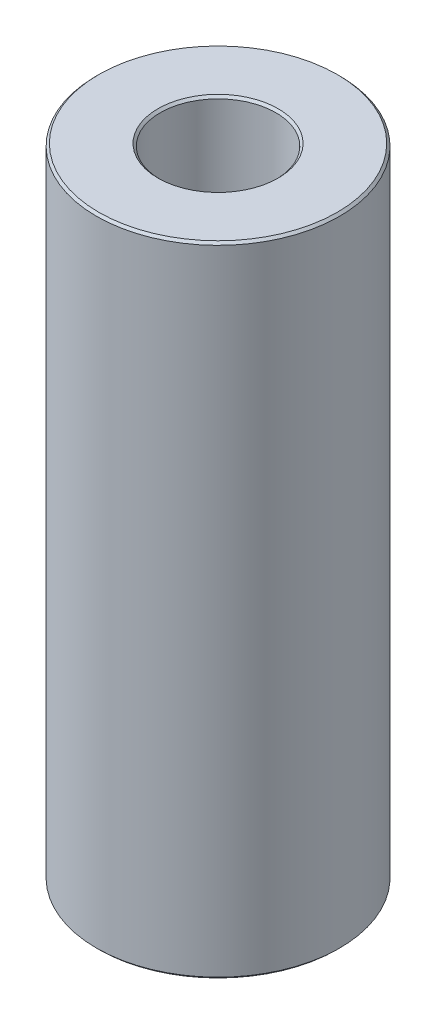
ISO-10303-21;
HEADER;
FILE_DESCRIPTION(('STEP AP214'),'2;1');
FILE_NAME('part.step','',(''),(''),'','','');
FILE_SCHEMA(('AUTOMOTIVE_DESIGN { 1 0 10303 214 1 1 1 1 }'));
ENDSEC;
DATA;
#1=APPLICATION_CONTEXT('core data for automotive mechanical design processes');
#2=APPLICATION_PROTOCOL_DEFINITION('international standard','automotive_design',2000,#1);
#3=PRODUCT_CONTEXT('',#1,'mechanical');
#4=PRODUCT('Part','Part','',(#3));
#5=PRODUCT_RELATED_PRODUCT_CATEGORY('part','',(#4));
#6=PRODUCT_DEFINITION_FORMATION('','',#4);
#7=PRODUCT_DEFINITION_CONTEXT('part definition',#1,'design');
#8=PRODUCT_DEFINITION('design','',#6,#7);
#9=PRODUCT_DEFINITION_SHAPE('','',#8);
#10=(LENGTH_UNIT() NAMED_UNIT(*) SI_UNIT(.MILLI.,.METRE.));
#11=(NAMED_UNIT(*) PLANE_ANGLE_UNIT() SI_UNIT($,.RADIAN.));
#12=(NAMED_UNIT(*) SI_UNIT($,.STERADIAN.) SOLID_ANGLE_UNIT());
#13=UNCERTAINTY_MEASURE_WITH_UNIT(LENGTH_MEASURE(1.E-05),#10,'distance_accuracy_value','');
#14=(GEOMETRIC_REPRESENTATION_CONTEXT(3) GLOBAL_UNCERTAINTY_ASSIGNED_CONTEXT((#13)) GLOBAL_UNIT_ASSIGNED_CONTEXT((#10,
#11,#12)) REPRESENTATION_CONTEXT('',''));
#15=CARTESIAN_POINT('',(0.,0.,0.));
#16=DIRECTION('',(0.,0.,1.));
#17=DIRECTION('',(1.,0.,0.));
#18=AXIS2_PLACEMENT_3D('',#15,#16,#17);
#19=CARTESIAN_POINT('',(0.,223.140577602893,0.));
#20=DIRECTION('',(0.,-1.,0.));
#21=DIRECTION('',(0.,0.,-1.));
#22=AXIS2_PLACEMENT_3D('',#19,#20,#21);
#23=CYLINDRICAL_SURFACE('',#22,42.5);
#24=CARTESIAN_POINT('',(0.,0.808248224856506,0.));
#25=DIRECTION('',(0.,1.,0.));
#26=DIRECTION('',(0.,0.,1.));
#27=AXIS2_PLACEMENT_3D('',#24,#25,#26);
#28=CIRCLE('',#27,42.5);
#29=CARTESIAN_POINT('',(0.,0.808248224856506,42.5));
#30=VERTEX_POINT('',#29);
#31=EDGE_CURVE('E10',#30,#30,#28,.T.);
#32=ORIENTED_EDGE('',*,*,#31,.T.);
#33=EDGE_LOOP('',(#32));
#34=FACE_BOUND('',#33,.T.);
#35=CARTESIAN_POINT('',(0.,222.332329378037,0.));
#36=DIRECTION('',(0.,1.,0.));
#37=DIRECTION('',(0.,0.,1.));
#38=AXIS2_PLACEMENT_3D('',#35,#36,#37);
#39=CIRCLE('',#38,42.5);
#40=CARTESIAN_POINT('',(0.,222.332329378037,42.5));
#41=VERTEX_POINT('',#40);
#42=EDGE_CURVE('E50',#41,#41,#39,.F.);
#43=ORIENTED_EDGE('',*,*,#42,.T.);
#44=EDGE_LOOP('',(#43));
#45=FACE_BOUND('',#44,.T.);
#46=ADVANCED_FACE('F39',(#34,#45),#23,.T.);
#47=CARTESIAN_POINT('',(0.,223.140577602893,0.));
#48=DIRECTION('',(0.,1.,0.));
#49=DIRECTION('',(0.,0.,1.));
#50=AXIS2_PLACEMENT_3D('',#47,#48,#49);
#51=PLANE('',#50);
#52=CARTESIAN_POINT('',(0.,223.140577602893,0.));
#53=DIRECTION('',(0.,1.,0.));
#54=DIRECTION('',(0.,0.,1.));
#55=AXIS2_PLACEMENT_3D('',#52,#53,#54);
#56=CIRCLE('',#55,21.0218103861378);
#57=CARTESIAN_POINT('',(0.,223.140577602893,21.0218103861378));
#58=VERTEX_POINT('',#57);
#59=EDGE_CURVE('E58',#58,#58,#56,.F.);
#60=ORIENTED_EDGE('',*,*,#59,.T.);
#61=EDGE_LOOP('',(#60));
#62=FACE_BOUND('',#61,.T.);
#63=CARTESIAN_POINT('',(0.,223.140577602893,0.));
#64=DIRECTION('',(0.,1.,0.));
#65=DIRECTION('',(0.,0.,1.));
#66=AXIS2_PLACEMENT_3D('',#63,#64,#65);
#67=CIRCLE('',#66,41.6917517751436);
#68=CARTESIAN_POINT('',(0.,223.140577602893,41.6917517751436));
#69=VERTEX_POINT('',#68);
#70=EDGE_CURVE('E61',#69,#69,#67,.T.);
#71=ORIENTED_EDGE('',*,*,#70,.T.);
#72=EDGE_LOOP('',(#71));
#73=FACE_BOUND('',#72,.T.);
#74=ADVANCED_FACE('F88',(#62,#73),#51,.T.);
#75=CARTESIAN_POINT('',(0.,0.,0.));
#76=DIRECTION('',(0.,1.,0.));
#77=DIRECTION('',(0.,0.,1.));
#78=AXIS2_PLACEMENT_3D('',#75,#76,#77);
#79=PLANE('',#78);
#80=CARTESIAN_POINT('',(0.,0.,0.));
#81=DIRECTION('',(0.,1.,0.));
#82=DIRECTION('',(0.,0.,1.));
#83=AXIS2_PLACEMENT_3D('',#80,#81,#82);
#84=CIRCLE('',#83,21.0218103861378);
#85=CARTESIAN_POINT('',(0.,0.,21.0218103861378));
#86=VERTEX_POINT('',#85);
#87=EDGE_CURVE('E51',#86,#86,#84,.T.);
#88=ORIENTED_EDGE('',*,*,#87,.T.);
#89=EDGE_LOOP('',(#88));
#90=FACE_BOUND('',#89,.T.);
#91=CARTESIAN_POINT('',(0.,0.,0.));
#92=DIRECTION('',(0.,1.,0.));
#93=DIRECTION('',(0.,0.,1.));
#94=AXIS2_PLACEMENT_3D('',#91,#92,#93);
#95=CIRCLE('',#94,41.6917517751435);
#96=CARTESIAN_POINT('',(0.,0.,41.6917517751435));
#97=VERTEX_POINT('',#96);
#98=EDGE_CURVE('E54',#97,#97,#95,.F.);
#99=ORIENTED_EDGE('',*,*,#98,.T.);
#100=EDGE_LOOP('',(#99));
#101=FACE_BOUND('',#100,.T.);
#102=ADVANCED_FACE('F83',(#90,#101),#79,.F.);
#103=CARTESIAN_POINT('',(0.,223.140577602893,0.));
#104=DIRECTION('',(0.,-1.,0.));
#105=DIRECTION('',(0.,0.,-1.));
#106=AXIS2_PLACEMENT_3D('',#103,#104,#105);
#107=CYLINDRICAL_SURFACE('',#106,20.2135621612813);
#108=CARTESIAN_POINT('',(0.,222.332329378037,0.));
#109=DIRECTION('',(0.,1.,0.));
#110=DIRECTION('',(0.,0.,1.));
#111=AXIS2_PLACEMENT_3D('',#108,#109,#110);
#112=CIRCLE('',#111,20.2135621612813);
#113=CARTESIAN_POINT('',(0.,222.332329378037,20.2135621612813));
#114=VERTEX_POINT('',#113);
#115=EDGE_CURVE('E67',#114,#114,#112,.T.);
#116=ORIENTED_EDGE('',*,*,#115,.T.);
#117=EDGE_LOOP('',(#116));
#118=FACE_BOUND('',#117,.T.);
#119=CARTESIAN_POINT('',(0.,0.808248224856478,0.));
#120=DIRECTION('',(0.,1.,0.));
#121=DIRECTION('',(0.,0.,1.));
#122=AXIS2_PLACEMENT_3D('',#119,#120,#121);
#123=CIRCLE('',#122,20.2135621612813);
#124=CARTESIAN_POINT('',(0.,0.808248224856478,20.2135621612813));
#125=VERTEX_POINT('',#124);
#126=EDGE_CURVE('E69',#125,#125,#123,.F.);
#127=ORIENTED_EDGE('',*,*,#126,.T.);
#128=EDGE_LOOP('',(#127));
#129=FACE_BOUND('',#128,.T.);
#130=ADVANCED_FACE('F71',(#118,#129),#107,.F.);
#131=CARTESIAN_POINT('',(0.,222.332329378037,0.));
#132=DIRECTION('',(0.,1.,0.));
#133=DIRECTION('',(0.,0.,1.));
#134=AXIS2_PLACEMENT_3D('',#131,#132,#133);
#135=CONICAL_SURFACE('',#134,20.2135621612813,0.785398163397446);
#136=ORIENTED_EDGE('',*,*,#59,.F.);
#137=EDGE_LOOP('',(#136));
#138=FACE_BOUND('',#137,.T.);
#139=ORIENTED_EDGE('',*,*,#115,.F.);
#140=EDGE_LOOP('',(#139));
#141=FACE_BOUND('',#140,.T.);
#142=ADVANCED_FACE('F77',(#138,#141),#135,.F.);
#143=CARTESIAN_POINT('',(0.,0.,0.));
#144=DIRECTION('',(0.,-1.,0.));
#145=DIRECTION('',(0.,0.,-1.));
#146=AXIS2_PLACEMENT_3D('',#143,#144,#145);
#147=CONICAL_SURFACE('',#146,21.0218103861378,0.785398163397429);
#148=ORIENTED_EDGE('',*,*,#126,.F.);
#149=EDGE_LOOP('',(#148));
#150=FACE_BOUND('',#149,.T.);
#151=ORIENTED_EDGE('',*,*,#87,.F.);
#152=EDGE_LOOP('',(#151));
#153=FACE_BOUND('',#152,.T.);
#154=ADVANCED_FACE('F73',(#150,#153),#147,.F.);
#155=CARTESIAN_POINT('',(0.,0.808248224856506,0.));
#156=DIRECTION('',(0.,1.,0.));
#157=DIRECTION('',(0.,0.,1.));
#158=AXIS2_PLACEMENT_3D('',#155,#156,#157);
#159=CONICAL_SURFACE('',#158,42.5,0.785398163397448);
#160=ORIENTED_EDGE('',*,*,#98,.F.);
#161=EDGE_LOOP('',(#160));
#162=FACE_BOUND('',#161,.T.);
#163=ORIENTED_EDGE('',*,*,#31,.F.);
#164=EDGE_LOOP('',(#163));
#165=FACE_BOUND('',#164,.T.);
#166=ADVANCED_FACE('F76',(#162,#165),#159,.T.);
#167=CARTESIAN_POINT('',(0.,223.140577602893,0.));
#168=DIRECTION('',(0.,-1.,0.));
#169=DIRECTION('',(0.,0.,-1.));
#170=AXIS2_PLACEMENT_3D('',#167,#168,#169);
#171=CONICAL_SURFACE('',#170,41.6917517751436,0.785398163397431);
#172=ORIENTED_EDGE('',*,*,#42,.F.);
#173=EDGE_LOOP('',(#172));
#174=FACE_BOUND('',#173,.T.);
#175=ORIENTED_EDGE('',*,*,#70,.F.);
#176=EDGE_LOOP('',(#175));
#177=FACE_BOUND('',#176,.T.);
#178=ADVANCED_FACE('F45',(#174,#177),#171,.T.);
#179=CLOSED_SHELL('',(#46,#74,#102,#130,#142,#154,#166,#178));
#180=MANIFOLD_SOLID_BREP('B2',#179);
#181=ADVANCED_BREP_SHAPE_REPRESENTATION('',(#18,#180),#14);
#182=SHAPE_DEFINITION_REPRESENTATION(#9,#181);
ENDSEC;
END-ISO-10303-21;
